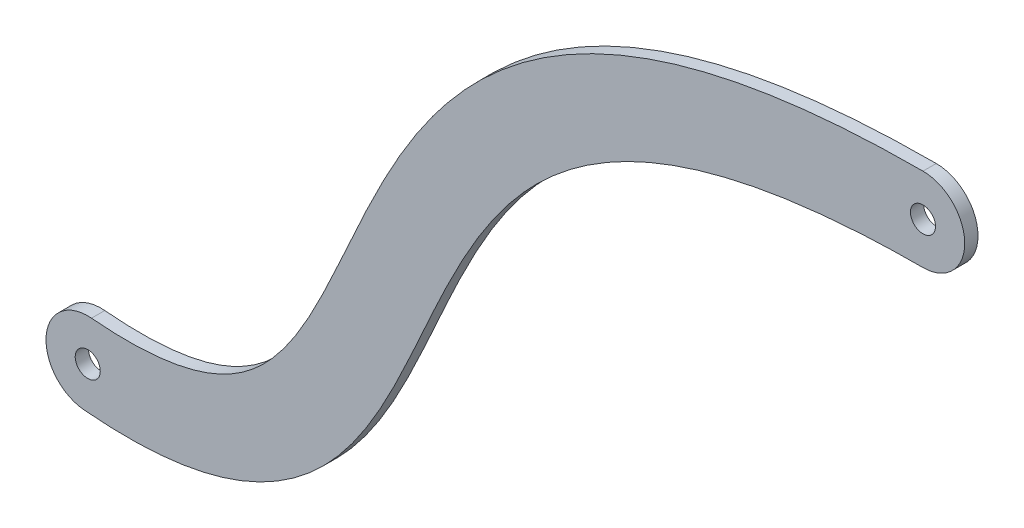
ISO-10303-21;
HEADER;
FILE_DESCRIPTION(('STEP AP214'),'2;1');
FILE_NAME('part.step','',(''),(''),'','','');
FILE_SCHEMA(('AUTOMOTIVE_DESIGN { 1 0 10303 214 1 1 1 1 }'));
ENDSEC;
DATA;
#1=APPLICATION_CONTEXT('core data for automotive mechanical design processes');
#2=APPLICATION_PROTOCOL_DEFINITION('international standard','automotive_design',2000,#1);
#3=PRODUCT_CONTEXT('',#1,'mechanical');
#4=PRODUCT('Part','Part','',(#3));
#5=PRODUCT_RELATED_PRODUCT_CATEGORY('part','',(#4));
#6=PRODUCT_DEFINITION_FORMATION('','',#4);
#7=PRODUCT_DEFINITION_CONTEXT('part definition',#1,'design');
#8=PRODUCT_DEFINITION('design','',#6,#7);
#9=PRODUCT_DEFINITION_SHAPE('','',#8);
#10=(LENGTH_UNIT() NAMED_UNIT(*) SI_UNIT(.MILLI.,.METRE.));
#11=(NAMED_UNIT(*) PLANE_ANGLE_UNIT() SI_UNIT($,.RADIAN.));
#12=(NAMED_UNIT(*) SI_UNIT($,.STERADIAN.) SOLID_ANGLE_UNIT());
#13=UNCERTAINTY_MEASURE_WITH_UNIT(LENGTH_MEASURE(1.E-05),#10,'distance_accuracy_value','');
#14=(GEOMETRIC_REPRESENTATION_CONTEXT(3) GLOBAL_UNCERTAINTY_ASSIGNED_CONTEXT((#13)) GLOBAL_UNIT_ASSIGNED_CONTEXT((#10,
#11,#12)) REPRESENTATION_CONTEXT('',''));
#15=CARTESIAN_POINT('',(0.,0.,0.));
#16=DIRECTION('',(0.,0.,1.));
#17=DIRECTION('',(1.,0.,0.));
#18=AXIS2_PLACEMENT_3D('',#15,#16,#17);
#19=CARTESIAN_POINT('',(-133.00424210074,-64.2145458749634,3.175));
#20=DIRECTION('',(0.,0.,-1.));
#21=DIRECTION('',(-1.,0.,0.));
#22=AXIS2_PLACEMENT_3D('',#19,#20,#21);
#23=PLANE('',#22);
#24=CARTESIAN_POINT('',(0.,10.,3.175));
#25=CARTESIAN_POINT('',(-1.33889613514963,10.,3.175));
#26=CARTESIAN_POINT('',(-4.03663128172452,9.98242040403843,3.175));
#27=CARTESIAN_POINT('',(-9.27187200661909,9.87784426097718,3.175));
#28=CARTESIAN_POINT('',(-15.6298635484323,9.61864254499767,3.175));
#29=CARTESIAN_POINT('',(-22.936639656001,9.10728368487111,3.175));
#30=CARTESIAN_POINT('',(-32.2737493854527,8.16521493908366,3.175));
#31=CARTESIAN_POINT('',(-43.2031259354624,6.51222283192773,3.175));
#32=CARTESIAN_POINT('',(-55.204214547986,3.80743716501185,3.175));
#33=CARTESIAN_POINT('',(-66.1554022153397,0.421098599483265,3.175));
#34=CARTESIAN_POINT('',(-79.433418063901,-4.94443655519622,3.175));
#35=CARTESIAN_POINT('',(-93.6755610177417,-13.1278823890349,3.175));
#36=CARTESIAN_POINT('',(-107.358604539385,-24.7932878903936,3.175));
#37=CARTESIAN_POINT('',(-118.079923604956,-37.6377288403778,3.175));
#38=CARTESIAN_POINT('',(-126.451066368868,-50.9979433209455,3.175));
#39=CARTESIAN_POINT('',(-133.16674490886,-64.3059377731845,3.175));
#40=CARTESIAN_POINT('',(-138.907406600132,-77.0655808360973,3.175));
#41=CARTESIAN_POINT('',(-144.288347952757,-88.7989765673839,3.175));
#42=CARTESIAN_POINT('',(-149.824694436047,-99.0275637463276,3.175));
#43=CARTESIAN_POINT('',(-155.898160468611,-107.3286099746,3.175));
#44=CARTESIAN_POINT('',(-161.669374507091,-112.527277268558,3.175));
#45=CARTESIAN_POINT('',(-167.083581014019,-115.769099961895,3.175));
#46=CARTESIAN_POINT('',(-171.708355928272,-117.756489287093,3.175));
#47=CARTESIAN_POINT('',(-177.065159674144,-119.270992125652,3.175));
#48=CARTESIAN_POINT('',(-182.267818177189,-120.080328974373,3.175));
#49=CARTESIAN_POINT('',(-186.933490647288,-120.409425437863,3.175));
#50=CARTESIAN_POINT('',(-190.693954849887,-120.485068398923,3.175));
#51=CARTESIAN_POINT('',(-194.06115057164,-120.394947781027,3.175));
#52=CARTESIAN_POINT('',(-196.883542887661,-120.226727876813,3.175));
#53=CARTESIAN_POINT('',(-198.365445289647,-120.1072126637,3.175));
#54=CARTESIAN_POINT('',(-199.096616617297,-120.040888670978,3.175));
#55=B_SPLINE_CURVE_WITH_KNOTS('',3,(#24,#25,#26,#27,#28,#29,#30,#31,#32,#33,#34,#35,#36,#37,#38,
#39,#40,#41,#42,#43,#44,#45,#46,#47,#48,#49,#50,#51,#52,#53,#54),.UNSPECIFIED.,.F.,.F.,(4,1,1,1,
1,1,1,1,1,1,1,1,1,1,1,1,1,1,1,1,1,1,1,1,1,1,1,1,4),(0.,0.0078125,0.015625,0.03125,0.046875,
0.0625,0.09375,0.125,0.15625,0.1875,0.25,0.3125,0.375,0.4375,0.5,0.5625,0.625,0.6875,0.75,
0.8125,0.84375,0.875,0.90625,0.9375,0.953125,0.96875,0.984375,0.9921875,1.),.UNSPECIFIED.);
#56=CARTESIAN_POINT('',(0.,10.,3.175));
#57=VERTEX_POINT('',#56);
#58=CARTESIAN_POINT('',(-199.096616617297,-120.040888670978,3.175));
#59=VERTEX_POINT('',#58);
#60=EDGE_CURVE('E86',#57,#59,#55,.T.);
#61=ORIENTED_EDGE('',*,*,#60,.T.);
#62=CARTESIAN_POINT('',(-200.,-130.,3.175));
#63=DIRECTION('',(0.,0.,1.));
#64=DIRECTION('',(1.,0.,0.));
#65=AXIS2_PLACEMENT_3D('',#62,#63,#64);
#66=CIRCLE('',#65,9.99999999999999);
#67=CARTESIAN_POINT('',(-200.903383382704,-139.959111329022,3.175));
#68=VERTEX_POINT('',#67);
#69=EDGE_CURVE('E81',#59,#68,#66,.T.);
#70=ORIENTED_EDGE('',*,*,#69,.T.);
#71=CARTESIAN_POINT('',(-200.903383382704,-139.959111329022,3.175));
#72=CARTESIAN_POINT('',(-200.037485643251,-140.037656251666,3.175));
#73=CARTESIAN_POINT('',(-198.289956322008,-140.17862471654,3.175));
#74=CARTESIAN_POINT('',(-194.902893504897,-140.380838582245,3.175));
#75=CARTESIAN_POINT('',(-190.788685764277,-140.492078652854,3.175));
#76=CARTESIAN_POINT('',(-186.058063141085,-140.39869804796,3.175));
#77=CARTESIAN_POINT('',(-180.005628003493,-139.974310928659,3.175));
#78=CARTESIAN_POINT('',(-172.903862455241,-138.883709630383,3.175));
#79=CARTESIAN_POINT('',(-165.090036196037,-136.691162646846,3.175));
#80=CARTESIAN_POINT('',(-157.988102872956,-133.6498522325,3.175));
#81=CARTESIAN_POINT('',(-149.489597913526,-128.56529396206,3.175));
#82=CARTESIAN_POINT('',(-140.721639831716,-120.579621108576,3.175));
#83=CARTESIAN_POINT('',(-132.698495585438,-109.461640852802,3.175));
#84=CARTESIAN_POINT('',(-126.276327656443,-97.5177426267473,3.175));
#85=CARTESIAN_POINT('',(-120.624536438267,-85.169554654853,3.175));
#86=CARTESIAN_POINT('',(-115.045937003846,-72.7828760078249,3.175));
#87=CARTESIAN_POINT('',(-108.943514578213,-60.7241711235696,3.175));
#88=CARTESIAN_POINT('',(-101.785405177486,-49.3416689975069,3.175));
#89=CARTESIAN_POINT('',(-93.0540107051504,-38.9117364335156,3.175));
#90=CARTESIAN_POINT('',(-82.1485644761046,-29.6154718746374,3.175));
#91=CARTESIAN_POINT('',(-70.6102379909628,-22.9617458376786,3.175));
#92=CARTESIAN_POINT('',(-59.4836601988568,-18.4582555840682,3.175));
#93=CARTESIAN_POINT('',(-50.0898202762795,-15.5487261827362,3.175));
#94=CARTESIAN_POINT('',(-39.552493021452,-13.1690900173284,3.175));
#95=CARTESIAN_POINT('',(-29.7465858047327,-11.6825565806459,3.175));
#96=CARTESIAN_POINT('',(-21.245865223065,-10.8242730038116,3.175));
#97=CARTESIAN_POINT('',(-14.5352953348343,-10.3541948088439,3.175));
#98=CARTESIAN_POINT('',(-8.6477142276719,-10.1138825768445,3.175));
#99=CARTESIAN_POINT('',(-3.77482080459714,-10.0164542856063,3.175));
#100=CARTESIAN_POINT('',(-1.25102086397396,-10.,3.175));
#101=CARTESIAN_POINT('',(0.,-10.,3.175));
#102=B_SPLINE_CURVE_WITH_KNOTS('',3,(#71,#72,#73,#74,#75,#76,#77,#78,#79,#80,#81,#82,#83,#84,
#85,#86,#87,#88,#89,#90,#91,#92,#93,#94,#95,#96,#97,#98,#99,#100,#101),.UNSPECIFIED.,.F.,.F.,(4,
1,1,1,1,1,1,1,1,1,1,1,1,1,1,1,1,1,1,1,1,1,1,1,1,1,1,1,4),(0.,0.0078125,0.015625,0.03125,
0.046875,0.0625,0.09375,0.125,0.15625,0.1875,0.25,0.3125,0.375,0.4375,0.5,0.5625,0.625,0.6875,
0.75,0.8125,0.84375,0.875,0.90625,0.9375,0.953125,0.96875,0.984375,0.9921875,1.),.UNSPECIFIED.);
#103=CARTESIAN_POINT('',(0.,-10.,3.175));
#104=VERTEX_POINT('',#103);
#105=EDGE_CURVE('E84',#68,#104,#102,.T.);
#106=ORIENTED_EDGE('',*,*,#105,.T.);
#107=CARTESIAN_POINT('',(0.,0.,3.175));
#108=DIRECTION('',(0.,0.,1.));
#109=DIRECTION('',(-1.,0.,0.));
#110=AXIS2_PLACEMENT_3D('',#107,#108,#109);
#111=CIRCLE('',#110,10.);
#112=EDGE_CURVE('E51',#104,#57,#111,.T.);
#113=ORIENTED_EDGE('',*,*,#112,.T.);
#114=EDGE_LOOP('',(#61,#70,#106,#113));
#115=FACE_BOUND('',#114,.T.);
#116=CARTESIAN_POINT('',(-200.,-130.,3.175));
#117=DIRECTION('',(0.,0.,1.));
#118=DIRECTION('',(1.,0.,0.));
#119=AXIS2_PLACEMENT_3D('',#116,#117,#118);
#120=CIRCLE('',#119,2.99999999999999);
#121=CARTESIAN_POINT('',(-197.,-130.,3.175));
#122=VERTEX_POINT('',#121);
#123=EDGE_CURVE('E142',#122,#122,#120,.T.);
#124=ORIENTED_EDGE('',*,*,#123,.F.);
#125=EDGE_LOOP('',(#124));
#126=FACE_BOUND('',#125,.T.);
#127=CARTESIAN_POINT('',(0.,0.,3.175));
#128=DIRECTION('',(0.,0.,1.));
#129=DIRECTION('',(1.,0.,0.));
#130=AXIS2_PLACEMENT_3D('',#127,#128,#129);
#131=CIRCLE('',#130,3.);
#132=CARTESIAN_POINT('',(3.,0.,3.175));
#133=VERTEX_POINT('',#132);
#134=EDGE_CURVE('E133',#133,#133,#131,.T.);
#135=ORIENTED_EDGE('',*,*,#134,.F.);
#136=EDGE_LOOP('',(#135));
#137=FACE_BOUND('',#136,.T.);
#138=ADVANCED_FACE('F33',(#115,#126,#137),#23,.F.);
#139=CARTESIAN_POINT('',(-133.00424210074,-64.2145458749634,0.));
#140=DIRECTION('',(0.,0.,-1.));
#141=DIRECTION('',(-1.,0.,0.));
#142=AXIS2_PLACEMENT_3D('',#139,#140,#141);
#143=PLANE('',#142);
#144=CARTESIAN_POINT('',(-200.,-130.,0.));
#145=DIRECTION('',(0.,0.,1.));
#146=DIRECTION('',(1.,0.,0.));
#147=AXIS2_PLACEMENT_3D('',#144,#145,#146);
#148=CIRCLE('',#147,2.99999999999999);
#149=CARTESIAN_POINT('',(-197.,-130.,0.));
#150=VERTEX_POINT('',#149);
#151=EDGE_CURVE('E139',#150,#150,#148,.T.);
#152=ORIENTED_EDGE('',*,*,#151,.T.);
#153=EDGE_LOOP('',(#152));
#154=FACE_BOUND('',#153,.T.);
#155=CARTESIAN_POINT('',(0.,10.,0.));
#156=CARTESIAN_POINT('',(-1.33889613514963,10.,0.));
#157=CARTESIAN_POINT('',(-4.03663128172452,9.98242040403843,0.));
#158=CARTESIAN_POINT('',(-9.27187200661909,9.87784426097718,0.));
#159=CARTESIAN_POINT('',(-15.6298635484323,9.61864254499767,0.));
#160=CARTESIAN_POINT('',(-22.936639656001,9.10728368487111,0.));
#161=CARTESIAN_POINT('',(-32.2737493854527,8.16521493908366,0.));
#162=CARTESIAN_POINT('',(-43.2031259354624,6.51222283192773,0.));
#163=CARTESIAN_POINT('',(-55.204214547986,3.80743716501185,0.));
#164=CARTESIAN_POINT('',(-66.1554022153397,0.421098599483265,0.));
#165=CARTESIAN_POINT('',(-79.433418063901,-4.94443655519622,0.));
#166=CARTESIAN_POINT('',(-93.6755610177417,-13.1278823890349,0.));
#167=CARTESIAN_POINT('',(-107.358604539385,-24.7932878903936,0.));
#168=CARTESIAN_POINT('',(-118.079923604956,-37.6377288403778,0.));
#169=CARTESIAN_POINT('',(-126.451066368868,-50.9979433209455,0.));
#170=CARTESIAN_POINT('',(-133.16674490886,-64.3059377731845,0.));
#171=CARTESIAN_POINT('',(-138.907406600132,-77.0655808360973,0.));
#172=CARTESIAN_POINT('',(-144.288347952757,-88.7989765673839,0.));
#173=CARTESIAN_POINT('',(-149.824694436047,-99.0275637463276,0.));
#174=CARTESIAN_POINT('',(-155.898160468611,-107.3286099746,0.));
#175=CARTESIAN_POINT('',(-161.669374507091,-112.527277268558,0.));
#176=CARTESIAN_POINT('',(-167.083581014019,-115.769099961895,0.));
#177=CARTESIAN_POINT('',(-171.708355928272,-117.756489287093,0.));
#178=CARTESIAN_POINT('',(-177.065159674144,-119.270992125652,0.));
#179=CARTESIAN_POINT('',(-182.267818177189,-120.080328974373,0.));
#180=CARTESIAN_POINT('',(-186.933490647288,-120.409425437863,0.));
#181=CARTESIAN_POINT('',(-190.693954849887,-120.485068398923,0.));
#182=CARTESIAN_POINT('',(-194.06115057164,-120.394947781027,0.));
#183=CARTESIAN_POINT('',(-196.883542887661,-120.226727876813,0.));
#184=CARTESIAN_POINT('',(-198.365445289647,-120.1072126637,0.));
#185=CARTESIAN_POINT('',(-199.096616617297,-120.040888670978,0.));
#186=B_SPLINE_CURVE_WITH_KNOTS('',3,(#155,#156,#157,#158,#159,#160,#161,#162,#163,#164,#165,
#166,#167,#168,#169,#170,#171,#172,#173,#174,#175,#176,#177,#178,#179,#180,#181,#182,#183,#184,
#185),.UNSPECIFIED.,.F.,.F.,(4,1,1,1,1,1,1,1,1,1,1,1,1,1,1,1,1,1,1,1,1,1,1,1,1,1,1,1,4),(0.,
0.0078125,0.015625,0.03125,0.046875,0.0625,0.09375,0.125,0.15625,0.1875,0.25,0.3125,0.375,
0.4375,0.5,0.5625,0.625,0.6875,0.75,0.8125,0.84375,0.875,0.90625,0.9375,0.953125,0.96875,
0.984375,0.9921875,1.),.UNSPECIFIED.);
#187=CARTESIAN_POINT('',(0.,10.,0.));
#188=VERTEX_POINT('',#187);
#189=CARTESIAN_POINT('',(-199.096616617297,-120.040888670978,0.));
#190=VERTEX_POINT('',#189);
#191=EDGE_CURVE('E145',#188,#190,#186,.T.);
#192=ORIENTED_EDGE('',*,*,#191,.F.);
#193=CARTESIAN_POINT('',(0.,0.,0.));
#194=DIRECTION('',(0.,0.,1.));
#195=DIRECTION('',(-1.,0.,0.));
#196=AXIS2_PLACEMENT_3D('',#193,#194,#195);
#197=CIRCLE('',#196,10.);
#198=CARTESIAN_POINT('',(0.,-10.,0.));
#199=VERTEX_POINT('',#198);
#200=EDGE_CURVE('E74',#199,#188,#197,.T.);
#201=ORIENTED_EDGE('',*,*,#200,.F.);
#202=CARTESIAN_POINT('',(-200.903383382704,-139.959111329022,0.));
#203=CARTESIAN_POINT('',(-200.037485643251,-140.037656251666,0.));
#204=CARTESIAN_POINT('',(-198.289956322008,-140.17862471654,0.));
#205=CARTESIAN_POINT('',(-194.902893504897,-140.380838582245,0.));
#206=CARTESIAN_POINT('',(-190.788685764277,-140.492078652854,0.));
#207=CARTESIAN_POINT('',(-186.058063141085,-140.39869804796,0.));
#208=CARTESIAN_POINT('',(-180.005628003493,-139.974310928659,0.));
#209=CARTESIAN_POINT('',(-172.903862455241,-138.883709630383,0.));
#210=CARTESIAN_POINT('',(-165.090036196037,-136.691162646846,0.));
#211=CARTESIAN_POINT('',(-157.988102872956,-133.6498522325,0.));
#212=CARTESIAN_POINT('',(-149.489597913526,-128.56529396206,0.));
#213=CARTESIAN_POINT('',(-140.721639831716,-120.579621108576,0.));
#214=CARTESIAN_POINT('',(-132.698495585438,-109.461640852802,0.));
#215=CARTESIAN_POINT('',(-126.276327656443,-97.5177426267473,0.));
#216=CARTESIAN_POINT('',(-120.624536438267,-85.169554654853,0.));
#217=CARTESIAN_POINT('',(-115.045937003846,-72.7828760078249,0.));
#218=CARTESIAN_POINT('',(-108.943514578213,-60.7241711235696,0.));
#219=CARTESIAN_POINT('',(-101.785405177486,-49.3416689975069,0.));
#220=CARTESIAN_POINT('',(-93.0540107051504,-38.9117364335156,0.));
#221=CARTESIAN_POINT('',(-82.1485644761046,-29.6154718746374,0.));
#222=CARTESIAN_POINT('',(-70.6102379909628,-22.9617458376786,0.));
#223=CARTESIAN_POINT('',(-59.4836601988568,-18.4582555840682,0.));
#224=CARTESIAN_POINT('',(-50.0898202762795,-15.5487261827362,0.));
#225=CARTESIAN_POINT('',(-39.552493021452,-13.1690900173284,0.));
#226=CARTESIAN_POINT('',(-29.7465858047327,-11.6825565806459,0.));
#227=CARTESIAN_POINT('',(-21.245865223065,-10.8242730038116,0.));
#228=CARTESIAN_POINT('',(-14.5352953348343,-10.3541948088439,0.));
#229=CARTESIAN_POINT('',(-8.6477142276719,-10.1138825768445,0.));
#230=CARTESIAN_POINT('',(-3.77482080459714,-10.0164542856063,0.));
#231=CARTESIAN_POINT('',(-1.25102086397396,-10.,0.));
#232=CARTESIAN_POINT('',(0.,-10.,0.));
#233=B_SPLINE_CURVE_WITH_KNOTS('',3,(#202,#203,#204,#205,#206,#207,#208,#209,#210,#211,#212,
#213,#214,#215,#216,#217,#218,#219,#220,#221,#222,#223,#224,#225,#226,#227,#228,#229,#230,#231,
#232),.UNSPECIFIED.,.F.,.F.,(4,1,1,1,1,1,1,1,1,1,1,1,1,1,1,1,1,1,1,1,1,1,1,1,1,1,1,1,4),(0.,
0.0078125,0.015625,0.03125,0.046875,0.0625,0.09375,0.125,0.15625,0.1875,0.25,0.3125,0.375,
0.4375,0.5,0.5625,0.625,0.6875,0.75,0.8125,0.84375,0.875,0.90625,0.9375,0.953125,0.96875,
0.984375,0.9921875,1.),.UNSPECIFIED.);
#234=CARTESIAN_POINT('',(-200.903383382704,-139.959111329022,0.));
#235=VERTEX_POINT('',#234);
#236=EDGE_CURVE('E68',#235,#199,#233,.T.);
#237=ORIENTED_EDGE('',*,*,#236,.F.);
#238=CARTESIAN_POINT('',(-200.,-130.,0.));
#239=DIRECTION('',(0.,0.,1.));
#240=DIRECTION('',(1.,0.,0.));
#241=AXIS2_PLACEMENT_3D('',#238,#239,#240);
#242=CIRCLE('',#241,9.99999999999999);
#243=EDGE_CURVE('E90',#190,#235,#242,.T.);
#244=ORIENTED_EDGE('',*,*,#243,.F.);
#245=EDGE_LOOP('',(#192,#201,#237,#244));
#246=FACE_BOUND('',#245,.T.);
#247=CARTESIAN_POINT('',(0.,0.,0.));
#248=DIRECTION('',(0.,0.,1.));
#249=DIRECTION('',(1.,0.,0.));
#250=AXIS2_PLACEMENT_3D('',#247,#248,#249);
#251=CIRCLE('',#250,3.);
#252=CARTESIAN_POINT('',(3.,0.,0.));
#253=VERTEX_POINT('',#252);
#254=EDGE_CURVE('E136',#253,#253,#251,.T.);
#255=ORIENTED_EDGE('',*,*,#254,.T.);
#256=EDGE_LOOP('',(#255));
#257=FACE_BOUND('',#256,.T.);
#258=ADVANCED_FACE('F112',(#154,#246,#257),#143,.T.);
#259=DIRECTION('',(0.,0.,-1.));
#260=VECTOR('',#259,1.);
#261=SURFACE_OF_LINEAR_EXTRUSION('',#55,#260);
#262=ORIENTED_EDGE('',*,*,#191,.T.);
#263=DIRECTION('',(0.,0.,-1.));
#264=VECTOR('',#263,1.);
#265=CARTESIAN_POINT('',(-199.096616617297,-120.040888670978,3.175));
#266=LINE('',#265,#264);
#267=EDGE_CURVE('E11',#59,#190,#266,.T.);
#268=ORIENTED_EDGE('',*,*,#267,.F.);
#269=ORIENTED_EDGE('',*,*,#60,.F.);
#270=DIRECTION('',(0.,0.,-1.));
#271=VECTOR('',#270,1.);
#272=CARTESIAN_POINT('',(0.,10.,3.175));
#273=LINE('',#272,#271);
#274=EDGE_CURVE('E94',#57,#188,#273,.T.);
#275=ORIENTED_EDGE('',*,*,#274,.T.);
#276=EDGE_LOOP('',(#262,#268,#269,#275));
#277=FACE_BOUND('',#276,.T.);
#278=ADVANCED_FACE('F35',(#277),#261,.F.);
#279=CARTESIAN_POINT('',(-200.,-130.,3.175));
#280=DIRECTION('',(0.,0.,-1.));
#281=DIRECTION('',(-1.,0.,0.));
#282=AXIS2_PLACEMENT_3D('',#279,#280,#281);
#283=CYLINDRICAL_SURFACE('',#282,9.99999999999999);
#284=ORIENTED_EDGE('',*,*,#243,.T.);
#285=DIRECTION('',(0.,0.,-1.));
#286=VECTOR('',#285,1.);
#287=CARTESIAN_POINT('',(-200.903383382704,-139.959111329022,3.175));
#288=LINE('',#287,#286);
#289=EDGE_CURVE('E43',#68,#235,#288,.T.);
#290=ORIENTED_EDGE('',*,*,#289,.F.);
#291=ORIENTED_EDGE('',*,*,#69,.F.);
#292=ORIENTED_EDGE('',*,*,#267,.T.);
#293=EDGE_LOOP('',(#284,#290,#291,#292));
#294=FACE_BOUND('',#293,.T.);
#295=ADVANCED_FACE('F89',(#294),#283,.T.);
#296=DIRECTION('',(0.,0.,-1.));
#297=VECTOR('',#296,1.);
#298=SURFACE_OF_LINEAR_EXTRUSION('',#102,#297);
#299=ORIENTED_EDGE('',*,*,#236,.T.);
#300=DIRECTION('',(0.,0.,-1.));
#301=VECTOR('',#300,1.);
#302=CARTESIAN_POINT('',(0.,-10.,3.175));
#303=LINE('',#302,#301);
#304=EDGE_CURVE('E91',#104,#199,#303,.T.);
#305=ORIENTED_EDGE('',*,*,#304,.F.);
#306=ORIENTED_EDGE('',*,*,#105,.F.);
#307=ORIENTED_EDGE('',*,*,#289,.T.);
#308=EDGE_LOOP('',(#299,#305,#306,#307));
#309=FACE_BOUND('',#308,.T.);
#310=ADVANCED_FACE('F92',(#309),#298,.F.);
#311=CARTESIAN_POINT('',(0.,0.,3.175));
#312=DIRECTION('',(0.,0.,-1.));
#313=DIRECTION('',(-1.,0.,0.));
#314=AXIS2_PLACEMENT_3D('',#311,#312,#313);
#315=CYLINDRICAL_SURFACE('',#314,10.);
#316=ORIENTED_EDGE('',*,*,#200,.T.);
#317=ORIENTED_EDGE('',*,*,#274,.F.);
#318=ORIENTED_EDGE('',*,*,#112,.F.);
#319=ORIENTED_EDGE('',*,*,#304,.T.);
#320=EDGE_LOOP('',(#316,#317,#318,#319));
#321=FACE_BOUND('',#320,.T.);
#322=ADVANCED_FACE('F106',(#321),#315,.T.);
#323=CARTESIAN_POINT('',(-200.,-130.,3.175));
#324=DIRECTION('',(0.,0.,-1.));
#325=DIRECTION('',(-1.,0.,0.));
#326=AXIS2_PLACEMENT_3D('',#323,#324,#325);
#327=CYLINDRICAL_SURFACE('',#326,2.99999999999999);
#328=ORIENTED_EDGE('',*,*,#123,.T.);
#329=EDGE_LOOP('',(#328));
#330=FACE_BOUND('',#329,.T.);
#331=ORIENTED_EDGE('',*,*,#151,.F.);
#332=EDGE_LOOP('',(#331));
#333=FACE_BOUND('',#332,.T.);
#334=ADVANCED_FACE('F121',(#330,#333),#327,.F.);
#335=CARTESIAN_POINT('',(0.,0.,3.175));
#336=DIRECTION('',(0.,0.,-1.));
#337=DIRECTION('',(-1.,0.,0.));
#338=AXIS2_PLACEMENT_3D('',#335,#336,#337);
#339=CYLINDRICAL_SURFACE('',#338,3.);
#340=ORIENTED_EDGE('',*,*,#134,.T.);
#341=EDGE_LOOP('',(#340));
#342=FACE_BOUND('',#341,.T.);
#343=ORIENTED_EDGE('',*,*,#254,.F.);
#344=EDGE_LOOP('',(#343));
#345=FACE_BOUND('',#344,.T.);
#346=ADVANCED_FACE('F124',(#342,#345),#339,.F.);
#347=CLOSED_SHELL('',(#138,#258,#278,#295,#310,#322,#334,#346));
#348=MANIFOLD_SOLID_BREP('B2',#347);
#349=ADVANCED_BREP_SHAPE_REPRESENTATION('',(#18,#348),#14);
#350=SHAPE_DEFINITION_REPRESENTATION(#9,#349);
ENDSEC;
END-ISO-10303-21;
